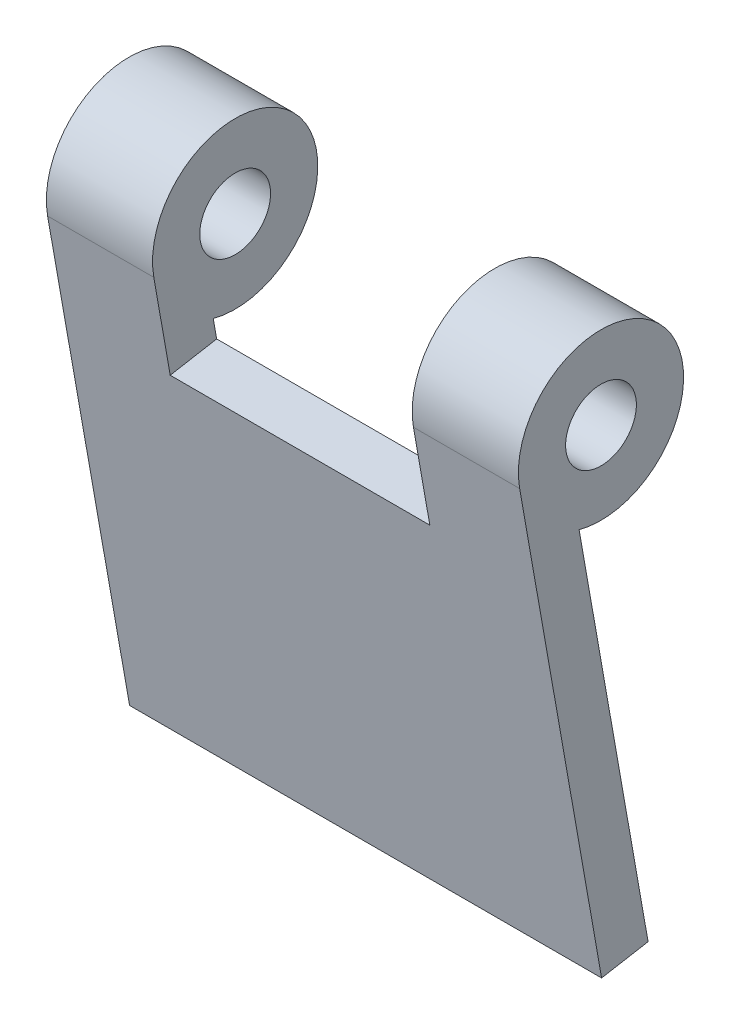
ISO-10303-21;
HEADER;
FILE_DESCRIPTION(('STEP AP214'),'2;1');
FILE_NAME('part.step','',(''),(''),'','','');
FILE_SCHEMA(('AUTOMOTIVE_DESIGN { 1 0 10303 214 1 1 1 1 }'));
ENDSEC;
DATA;
#1=APPLICATION_CONTEXT('core data for automotive mechanical design processes');
#2=APPLICATION_PROTOCOL_DEFINITION('international standard','automotive_design',2000,#1);
#3=PRODUCT_CONTEXT('',#1,'mechanical');
#4=PRODUCT('Part','Part','',(#3));
#5=PRODUCT_RELATED_PRODUCT_CATEGORY('part','',(#4));
#6=PRODUCT_DEFINITION_FORMATION('','',#4);
#7=PRODUCT_DEFINITION_CONTEXT('part definition',#1,'design');
#8=PRODUCT_DEFINITION('design','',#6,#7);
#9=PRODUCT_DEFINITION_SHAPE('','',#8);
#10=(LENGTH_UNIT() NAMED_UNIT(*) SI_UNIT(.MILLI.,.METRE.));
#11=(NAMED_UNIT(*) PLANE_ANGLE_UNIT() SI_UNIT($,.RADIAN.));
#12=(NAMED_UNIT(*) SI_UNIT($,.STERADIAN.) SOLID_ANGLE_UNIT());
#13=UNCERTAINTY_MEASURE_WITH_UNIT(LENGTH_MEASURE(1.E-05),#10,'distance_accuracy_value','');
#14=(GEOMETRIC_REPRESENTATION_CONTEXT(3) GLOBAL_UNCERTAINTY_ASSIGNED_CONTEXT((#13)) GLOBAL_UNIT_ASSIGNED_CONTEXT((#10,
#11,#12)) REPRESENTATION_CONTEXT('',''));
#15=CARTESIAN_POINT('',(0.,0.,0.));
#16=DIRECTION('',(0.,0.,1.));
#17=DIRECTION('',(1.,0.,0.));
#18=AXIS2_PLACEMENT_3D('',#15,#16,#17);
#19=CARTESIAN_POINT('',(661.894917120642,85.5761740117687,-295.009153101937));
#20=DIRECTION('',(-1.,0.,0.));
#21=DIRECTION('',(0.,0.,1.));
#22=AXIS2_PLACEMENT_3D('',#19,#20,#21);
#23=CYLINDRICAL_SURFACE('',#22,1.5);
#24=CARTESIAN_POINT('',(671.894917120642,85.5761740117687,-295.009153101937));
#25=DIRECTION('',(-1.,0.,0.));
#26=DIRECTION('',(0.,0.,1.));
#27=AXIS2_PLACEMENT_3D('',#24,#25,#26);
#28=CIRCLE('',#27,1.5);
#29=CARTESIAN_POINT('',(671.894917120642,85.5761740117687,-293.509153101937));
#30=VERTEX_POINT('',#29);
#31=EDGE_CURVE('E20',#30,#30,#28,.F.);
#32=ORIENTED_EDGE('',*,*,#31,.T.);
#33=EDGE_LOOP('',(#32));
#34=FACE_BOUND('',#33,.T.);
#35=CARTESIAN_POINT('',(667.394917120642,85.5761740117687,-295.009153101937));
#36=DIRECTION('',(-1.,0.,0.));
#37=DIRECTION('',(0.,0.,1.));
#38=AXIS2_PLACEMENT_3D('',#35,#36,#37);
#39=CIRCLE('',#38,1.5);
#40=CARTESIAN_POINT('',(667.394917120642,85.5761740117687,-293.509153101937));
#41=VERTEX_POINT('',#40);
#42=EDGE_CURVE('E160',#41,#41,#39,.F.);
#43=ORIENTED_EDGE('',*,*,#42,.F.);
#44=EDGE_LOOP('',(#43));
#45=FACE_BOUND('',#44,.T.);
#46=ADVANCED_FACE('F17',(#34,#45),#23,.F.);
#47=CARTESIAN_POINT('',(661.894917120642,65.6195466850241,-297.004905025757));
#48=DIRECTION('',(0.,0.173648177666933,-0.984807753012208));
#49=DIRECTION('',(0.,0.984807753012208,0.173648177666933));
#50=AXIS2_PLACEMENT_3D('',#47,#48,#49);
#51=PLANE('',#50);
#52=DIRECTION('',(1.,0.,0.));
#53=VECTOR('',#52,1.);
#54=CARTESIAN_POINT('',(661.894917120642,82.2014661883572,-294.081065225383));
#55=LINE('',#54,#53);
#56=CARTESIAN_POINT('',(667.394917120642,82.2014661883572,-294.081065225384));
#57=VERTEX_POINT('',#56);
#58=CARTESIAN_POINT('',(671.894917120642,82.2014661883572,-294.081065225384));
#59=VERTEX_POINT('',#58);
#60=EDGE_CURVE('E155',#57,#59,#55,.T.);
#61=ORIENTED_EDGE('',*,*,#60,.T.);
#62=DIRECTION('',(0.,-0.984807753012214,-0.173648177666897));
#63=VECTOR('',#62,1.);
#64=CARTESIAN_POINT('',(671.894917120642,82.2014661883573,-294.081065225384));
#65=LINE('',#64,#63);
#66=CARTESIAN_POINT('',(671.894917120642,65.6195466850241,-297.004905025757));
#67=VERTEX_POINT('',#66);
#68=EDGE_CURVE('E146',#59,#67,#65,.T.);
#69=ORIENTED_EDGE('',*,*,#68,.T.);
#70=DIRECTION('',(1.,0.,0.));
#71=VECTOR('',#70,1.);
#72=CARTESIAN_POINT('',(661.894917120642,65.6195466850241,-297.004905025757));
#73=LINE('',#72,#71);
#74=CARTESIAN_POINT('',(651.894917120642,65.6195466850241,-297.004905025757));
#75=VERTEX_POINT('',#74);
#76=EDGE_CURVE('E82',#75,#67,#73,.T.);
#77=ORIENTED_EDGE('',*,*,#76,.F.);
#78=DIRECTION('',(0.,-0.984807753012214,-0.173648177666897));
#79=VECTOR('',#78,1.);
#80=CARTESIAN_POINT('',(651.894917120642,82.2014661883573,-294.081065225384));
#81=LINE('',#80,#79);
#82=CARTESIAN_POINT('',(651.894917120642,82.2014661883572,-294.081065225384));
#83=VERTEX_POINT('',#82);
#84=EDGE_CURVE('E168',#83,#75,#81,.T.);
#85=ORIENTED_EDGE('',*,*,#84,.F.);
#86=DIRECTION('',(1.,0.,0.));
#87=VECTOR('',#86,1.);
#88=CARTESIAN_POINT('',(661.894917120642,82.2014661883572,-294.081065225383));
#89=LINE('',#88,#87);
#90=CARTESIAN_POINT('',(656.394917120642,82.2014661883572,-294.081065225384));
#91=VERTEX_POINT('',#90);
#92=EDGE_CURVE('E153',#83,#91,#89,.T.);
#93=ORIENTED_EDGE('',*,*,#92,.T.);
#94=DIRECTION('',(0.,-0.984807753012343,-0.173648177666166));
#95=VECTOR('',#94,1.);
#96=CARTESIAN_POINT('',(656.394917120642,82.2014661883573,-294.081065225384));
#97=LINE('',#96,#95);
#98=CARTESIAN_POINT('',(656.394917120642,81.3764707332194,-294.226534183086));
#99=VERTEX_POINT('',#98);
#100=EDGE_CURVE('E88',#91,#99,#97,.T.);
#101=ORIENTED_EDGE('',*,*,#100,.T.);
#102=DIRECTION('',(1.,0.,0.));
#103=VECTOR('',#102,1.);
#104=CARTESIAN_POINT('',(661.894917120642,81.3764707332193,-294.226534183086));
#105=LINE('',#104,#103);
#106=CARTESIAN_POINT('',(667.394917120642,81.3764707332194,-294.226534183086));
#107=VERTEX_POINT('',#106);
#108=EDGE_CURVE('E104',#99,#107,#105,.T.);
#109=ORIENTED_EDGE('',*,*,#108,.T.);
#110=DIRECTION('',(0.,-0.984807753012343,-0.173648177666166));
#111=VECTOR('',#110,1.);
#112=CARTESIAN_POINT('',(667.394917120642,82.2014661883573,-294.081065225384));
#113=LINE('',#112,#111);
#114=EDGE_CURVE('E133',#57,#107,#113,.T.);
#115=ORIENTED_EDGE('',*,*,#114,.F.);
#116=EDGE_LOOP('',(#61,#69,#77,#85,#93,#101,#109,#115));
#117=FACE_BOUND('',#116,.T.);
#118=ADVANCED_FACE('F188',(#117),#51,.T.);
#119=CARTESIAN_POINT('',(661.894917120642,85.5761740117687,-295.009153101937));
#120=DIRECTION('',(-1.,0.,0.));
#121=DIRECTION('',(0.,0.,1.));
#122=AXIS2_PLACEMENT_3D('',#119,#120,#121);
#123=CYLINDRICAL_SURFACE('',#122,1.5);
#124=CARTESIAN_POINT('',(651.894917120642,85.5761740117687,-295.009153101937));
#125=DIRECTION('',(-1.,0.,0.));
#126=DIRECTION('',(0.,0.,1.));
#127=AXIS2_PLACEMENT_3D('',#124,#125,#126);
#128=CIRCLE('',#127,1.5);
#129=CARTESIAN_POINT('',(651.894917120642,85.5761740117687,-293.509153101937));
#130=VERTEX_POINT('',#129);
#131=EDGE_CURVE('E165',#130,#130,#128,.F.);
#132=ORIENTED_EDGE('',*,*,#131,.F.);
#133=EDGE_LOOP('',(#132));
#134=FACE_BOUND('',#133,.T.);
#135=CARTESIAN_POINT('',(656.394917120642,85.5761740117687,-295.009153101937));
#136=DIRECTION('',(-1.,0.,0.));
#137=DIRECTION('',(0.,0.,1.));
#138=AXIS2_PLACEMENT_3D('',#135,#136,#137);
#139=CIRCLE('',#138,1.5);
#140=CARTESIAN_POINT('',(656.394917120642,85.5761740117687,-293.509153101937));
#141=VERTEX_POINT('',#140);
#142=EDGE_CURVE('E106',#141,#141,#139,.F.);
#143=ORIENTED_EDGE('',*,*,#142,.T.);
#144=EDGE_LOOP('',(#143));
#145=FACE_BOUND('',#144,.T.);
#146=ADVANCED_FACE('F289',(#134,#145),#123,.F.);
#147=CARTESIAN_POINT('',(661.894917120642,65.2722503296903,-295.035289519733));
#148=DIRECTION('',(0.,-0.984807753012207,-0.173648177666934));
#149=DIRECTION('',(0.,0.173648177666934,-0.984807753012207));
#150=AXIS2_PLACEMENT_3D('',#147,#148,#149);
#151=PLANE('',#150);
#152=ORIENTED_EDGE('',*,*,#76,.T.);
#153=DIRECTION('',(0.,-0.173648177666945,0.984807753012205));
#154=VECTOR('',#153,1.);
#155=CARTESIAN_POINT('',(671.894917120642,65.6195466850241,-297.004905025757));
#156=LINE('',#155,#154);
#157=CARTESIAN_POINT('',(671.894917120642,65.2722503296903,-295.035289519733));
#158=VERTEX_POINT('',#157);
#159=EDGE_CURVE('E71',#67,#158,#156,.T.);
#160=ORIENTED_EDGE('',*,*,#159,.T.);
#161=DIRECTION('',(1.,0.,0.));
#162=VECTOR('',#161,1.);
#163=CARTESIAN_POINT('',(661.894917120642,65.2722503296903,-295.035289519733));
#164=LINE('',#163,#162);
#165=CARTESIAN_POINT('',(651.894917120642,65.2722503296903,-295.035289519733));
#166=VERTEX_POINT('',#165);
#167=EDGE_CURVE('E143',#166,#158,#164,.T.);
#168=ORIENTED_EDGE('',*,*,#167,.F.);
#169=DIRECTION('',(0.,-0.173648177666945,0.984807753012205));
#170=VECTOR('',#169,1.);
#171=CARTESIAN_POINT('',(651.894917120642,65.6195466850241,-297.004905025757));
#172=LINE('',#171,#170);
#173=EDGE_CURVE('E170',#75,#166,#172,.T.);
#174=ORIENTED_EDGE('',*,*,#173,.F.);
#175=EDGE_LOOP('',(#152,#160,#168,#174));
#176=FACE_BOUND('',#175,.T.);
#177=ADVANCED_FACE('F186',(#176),#151,.T.);
#178=CARTESIAN_POINT('',(671.894917120642,43.1757528863374,-362.871701067118));
#179=DIRECTION('',(-1.,0.,0.));
#180=DIRECTION('',(0.,0.,1.));
#181=AXIS2_PLACEMENT_3D('',#178,#179,#180);
#182=PLANE('',#181);
#183=ORIENTED_EDGE('',*,*,#31,.F.);
#184=EDGE_LOOP('',(#183));
#185=FACE_BOUND('',#184,.T.);
#186=ORIENTED_EDGE('',*,*,#68,.F.);
#187=CARTESIAN_POINT('',(671.894917120642,85.5761740117687,-295.009153101937));
#188=DIRECTION('',(-1.,0.,0.));
#189=DIRECTION('',(0.,0.,1.));
#190=AXIS2_PLACEMENT_3D('',#187,#188,#189);
#191=CIRCLE('',#190,3.49999999999989);
#192=CARTESIAN_POINT('',(671.894917120642,84.9684053899345,-291.562325966394));
#193=VERTEX_POINT('',#192);
#194=EDGE_CURVE('E62',#193,#59,#191,.T.);
#195=ORIENTED_EDGE('',*,*,#194,.F.);
#196=DIRECTION('',(0.,-0.984807753012208,-0.17364817766693));
#197=VECTOR('',#196,1.);
#198=CARTESIAN_POINT('',(671.894917120642,65.2722503296903,-295.035289519733));
#199=LINE('',#198,#197);
#200=EDGE_CURVE('E140',#158,#193,#199,.F.);
#201=ORIENTED_EDGE('',*,*,#200,.F.);
#202=ORIENTED_EDGE('',*,*,#159,.F.);
#203=EDGE_LOOP('',(#186,#195,#201,#202));
#204=FACE_BOUND('',#203,.T.);
#205=ADVANCED_FACE('F183',(#185,#204),#182,.F.);
#206=CARTESIAN_POINT('',(661.894917120642,85.5761740117687,-295.009153101937));
#207=DIRECTION('',(-1.,0.,0.));
#208=DIRECTION('',(0.,0.,1.));
#209=AXIS2_PLACEMENT_3D('',#206,#207,#208);
#210=CYLINDRICAL_SURFACE('',#209,3.49999999999989);
#211=DIRECTION('',(1.,0.,0.));
#212=VECTOR('',#211,1.);
#213=CARTESIAN_POINT('',(661.894917120642,84.9684053899345,-291.562325966394));
#214=LINE('',#213,#212);
#215=CARTESIAN_POINT('',(667.394917120642,84.9684053899345,-291.562325966394));
#216=VERTEX_POINT('',#215);
#217=EDGE_CURVE('E120',#193,#216,#214,.F.);
#218=ORIENTED_EDGE('',*,*,#217,.F.);
#219=ORIENTED_EDGE('',*,*,#194,.T.);
#220=ORIENTED_EDGE('',*,*,#60,.F.);
#221=CARTESIAN_POINT('',(667.394917120642,85.5761740117687,-295.009153101937));
#222=DIRECTION('',(-1.,0.,0.));
#223=DIRECTION('',(0.,0.,1.));
#224=AXIS2_PLACEMENT_3D('',#221,#222,#223);
#225=CIRCLE('',#224,3.49999999999989);
#226=EDGE_CURVE('E136',#216,#57,#225,.T.);
#227=ORIENTED_EDGE('',*,*,#226,.F.);
#228=EDGE_LOOP('',(#218,#219,#220,#227));
#229=FACE_BOUND('',#228,.T.);
#230=ADVANCED_FACE('F185',(#229),#210,.T.);
#231=CARTESIAN_POINT('',(667.394917120642,43.1757528863374,-362.871701067118));
#232=DIRECTION('',(-1.,0.,0.));
#233=DIRECTION('',(0.,0.,1.));
#234=AXIS2_PLACEMENT_3D('',#231,#232,#233);
#235=PLANE('',#234);
#236=ORIENTED_EDGE('',*,*,#42,.T.);
#237=EDGE_LOOP('',(#236));
#238=FACE_BOUND('',#237,.T.);
#239=DIRECTION('',(0.,-0.984807753012208,-0.17364817766693));
#240=VECTOR('',#239,1.);
#241=CARTESIAN_POINT('',(667.394917120642,65.2722503296903,-295.035289519733));
#242=LINE('',#241,#240);
#243=CARTESIAN_POINT('',(667.394917120642,81.0291743778856,-292.256918677062));
#244=VERTEX_POINT('',#243);
#245=EDGE_CURVE('E118',#216,#244,#242,.T.);
#246=ORIENTED_EDGE('',*,*,#245,.F.);
#247=ORIENTED_EDGE('',*,*,#226,.T.);
#248=ORIENTED_EDGE('',*,*,#114,.T.);
#249=DIRECTION('',(0.,0.173648177666934,-0.984807753012207));
#250=VECTOR('',#249,1.);
#251=CARTESIAN_POINT('',(667.394917120642,78.7096520886086,-279.102254087688));
#252=LINE('',#251,#250);
#253=EDGE_CURVE('E127',#107,#244,#252,.F.);
#254=ORIENTED_EDGE('',*,*,#253,.T.);
#255=EDGE_LOOP('',(#246,#247,#248,#254));
#256=FACE_BOUND('',#255,.T.);
#257=ADVANCED_FACE('F191',(#238,#256),#235,.T.);
#258=CARTESIAN_POINT('',(661.894917120642,78.7096520886086,-279.102254087688));
#259=DIRECTION('',(0.,-0.984807753012207,-0.173648177666934));
#260=DIRECTION('',(0.,0.173648177666934,-0.984807753012207));
#261=AXIS2_PLACEMENT_3D('',#258,#259,#260);
#262=PLANE('',#261);
#263=ORIENTED_EDGE('',*,*,#253,.F.);
#264=ORIENTED_EDGE('',*,*,#108,.F.);
#265=DIRECTION('',(0.,-0.173648177666941,0.984807753012206));
#266=VECTOR('',#265,1.);
#267=CARTESIAN_POINT('',(656.394917120642,81.3764707332194,-294.226534183086));
#268=LINE('',#267,#266);
#269=CARTESIAN_POINT('',(656.394917120642,81.0291743778856,-292.256918677062));
#270=VERTEX_POINT('',#269);
#271=EDGE_CURVE('E97',#99,#270,#268,.T.);
#272=ORIENTED_EDGE('',*,*,#271,.T.);
#273=DIRECTION('',(1.,0.,0.));
#274=VECTOR('',#273,1.);
#275=CARTESIAN_POINT('',(661.894917120642,81.0291743778856,-292.256918677062));
#276=LINE('',#275,#274);
#277=EDGE_CURVE('E102',#244,#270,#276,.F.);
#278=ORIENTED_EDGE('',*,*,#277,.F.);
#279=EDGE_LOOP('',(#263,#264,#272,#278));
#280=FACE_BOUND('',#279,.T.);
#281=ADVANCED_FACE('F100',(#280),#262,.F.);
#282=CARTESIAN_POINT('',(656.394917120642,43.1757528863374,-362.871701067118));
#283=DIRECTION('',(-1.,0.,0.));
#284=DIRECTION('',(0.,0.,1.));
#285=AXIS2_PLACEMENT_3D('',#282,#283,#284);
#286=PLANE('',#285);
#287=ORIENTED_EDGE('',*,*,#142,.F.);
#288=EDGE_LOOP('',(#287));
#289=FACE_BOUND('',#288,.T.);
#290=ORIENTED_EDGE('',*,*,#271,.F.);
#291=ORIENTED_EDGE('',*,*,#100,.F.);
#292=CARTESIAN_POINT('',(656.394917120642,85.5761740117687,-295.009153101937));
#293=DIRECTION('',(-1.,0.,0.));
#294=DIRECTION('',(0.,0.,1.));
#295=AXIS2_PLACEMENT_3D('',#292,#293,#294);
#296=CIRCLE('',#295,3.49999999999989);
#297=CARTESIAN_POINT('',(656.394917120642,84.9684053899345,-291.562325966394));
#298=VERTEX_POINT('',#297);
#299=EDGE_CURVE('E111',#298,#91,#296,.T.);
#300=ORIENTED_EDGE('',*,*,#299,.F.);
#301=DIRECTION('',(0.,-0.984807753012208,-0.17364817766693));
#302=VECTOR('',#301,1.);
#303=CARTESIAN_POINT('',(656.394917120642,65.2722503296903,-295.035289519733));
#304=LINE('',#303,#302);
#305=EDGE_CURVE('E109',#270,#298,#304,.F.);
#306=ORIENTED_EDGE('',*,*,#305,.F.);
#307=EDGE_LOOP('',(#290,#291,#300,#306));
#308=FACE_BOUND('',#307,.T.);
#309=ADVANCED_FACE('F110',(#289,#308),#286,.F.);
#310=CARTESIAN_POINT('',(661.894917120642,85.5761740117687,-295.009153101937));
#311=DIRECTION('',(-1.,0.,0.));
#312=DIRECTION('',(0.,0.,1.));
#313=AXIS2_PLACEMENT_3D('',#310,#311,#312);
#314=CYLINDRICAL_SURFACE('',#313,3.49999999999989);
#315=ORIENTED_EDGE('',*,*,#299,.T.);
#316=ORIENTED_EDGE('',*,*,#92,.F.);
#317=CARTESIAN_POINT('',(651.894917120642,85.5761740117687,-295.009153101937));
#318=DIRECTION('',(-1.,0.,0.));
#319=DIRECTION('',(0.,0.,1.));
#320=AXIS2_PLACEMENT_3D('',#317,#318,#319);
#321=CIRCLE('',#320,3.49999999999989);
#322=CARTESIAN_POINT('',(651.894917120642,84.9684053899345,-291.562325966394));
#323=VERTEX_POINT('',#322);
#324=EDGE_CURVE('E35',#323,#83,#321,.T.);
#325=ORIENTED_EDGE('',*,*,#324,.F.);
#326=DIRECTION('',(1.,0.,0.));
#327=VECTOR('',#326,1.);
#328=CARTESIAN_POINT('',(661.894917120642,84.9684053899345,-291.562325966394));
#329=LINE('',#328,#327);
#330=EDGE_CURVE('E26',#298,#323,#329,.F.);
#331=ORIENTED_EDGE('',*,*,#330,.F.);
#332=EDGE_LOOP('',(#315,#316,#325,#331));
#333=FACE_BOUND('',#332,.T.);
#334=ADVANCED_FACE('F214',(#333),#314,.T.);
#335=CARTESIAN_POINT('',(651.894917120642,43.1757528863374,-362.871701067118));
#336=DIRECTION('',(-1.,0.,0.));
#337=DIRECTION('',(0.,0.,1.));
#338=AXIS2_PLACEMENT_3D('',#335,#336,#337);
#339=PLANE('',#338);
#340=ORIENTED_EDGE('',*,*,#131,.T.);
#341=EDGE_LOOP('',(#340));
#342=FACE_BOUND('',#341,.T.);
#343=ORIENTED_EDGE('',*,*,#324,.T.);
#344=ORIENTED_EDGE('',*,*,#84,.T.);
#345=ORIENTED_EDGE('',*,*,#173,.T.);
#346=DIRECTION('',(0.,-0.984807753012208,-0.17364817766693));
#347=VECTOR('',#346,1.);
#348=CARTESIAN_POINT('',(651.894917120642,65.2722503296903,-295.035289519733));
#349=LINE('',#348,#347);
#350=EDGE_CURVE('E11',#323,#166,#349,.T.);
#351=ORIENTED_EDGE('',*,*,#350,.F.);
#352=EDGE_LOOP('',(#343,#344,#345,#351));
#353=FACE_BOUND('',#352,.T.);
#354=ADVANCED_FACE('F213',(#342,#353),#339,.T.);
#355=CARTESIAN_POINT('',(661.894917120642,65.2722503296903,-295.035289519733));
#356=DIRECTION('',(0.,-0.17364817766693,0.984807753012208));
#357=DIRECTION('',(0.,-0.984807753012208,-0.17364817766693));
#358=AXIS2_PLACEMENT_3D('',#355,#356,#357);
#359=PLANE('',#358);
#360=ORIENTED_EDGE('',*,*,#330,.T.);
#361=ORIENTED_EDGE('',*,*,#350,.T.);
#362=ORIENTED_EDGE('',*,*,#167,.T.);
#363=ORIENTED_EDGE('',*,*,#200,.T.);
#364=ORIENTED_EDGE('',*,*,#217,.T.);
#365=ORIENTED_EDGE('',*,*,#245,.T.);
#366=ORIENTED_EDGE('',*,*,#277,.T.);
#367=ORIENTED_EDGE('',*,*,#305,.T.);
#368=EDGE_LOOP('',(#360,#361,#362,#363,#364,#365,#366,#367));
#369=FACE_BOUND('',#368,.T.);
#370=ADVANCED_FACE('F115',(#369),#359,.T.);
#371=CLOSED_SHELL('',(#46,#118,#146,#177,#205,#230,#257,#281,#309,#334,#354,#370));
#372=MANIFOLD_SOLID_BREP('B1',#371);
#373=ADVANCED_BREP_SHAPE_REPRESENTATION('',(#18,#372),#14);
#374=SHAPE_DEFINITION_REPRESENTATION(#9,#373);
ENDSEC;
END-ISO-10303-21;
